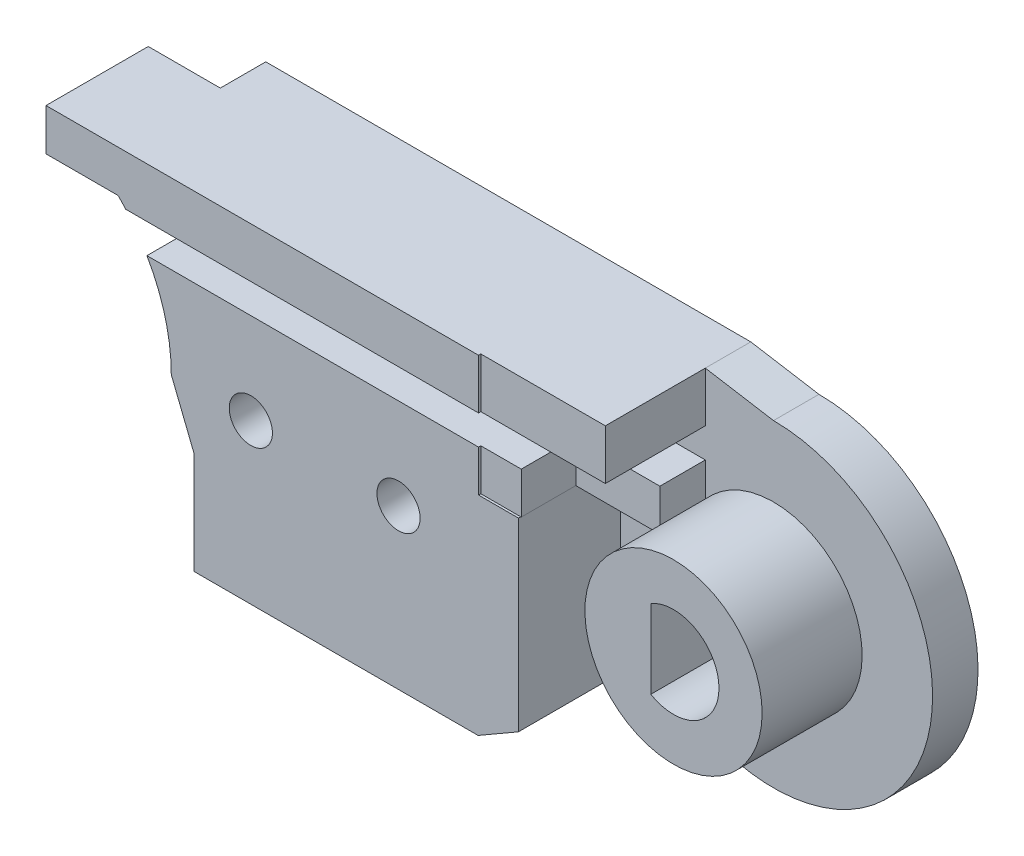
ISO-10303-21;
HEADER;
FILE_DESCRIPTION(('STEP AP214'),'2;1');
FILE_NAME('part.step','',(''),(''),'','','');
FILE_SCHEMA(('AUTOMOTIVE_DESIGN { 1 0 10303 214 1 1 1 1 }'));
ENDSEC;
DATA;
#1=APPLICATION_CONTEXT('core data for automotive mechanical design processes');
#2=APPLICATION_PROTOCOL_DEFINITION('international standard','automotive_design',2000,#1);
#3=PRODUCT_CONTEXT('',#1,'mechanical');
#4=PRODUCT('Part','Part','',(#3));
#5=PRODUCT_RELATED_PRODUCT_CATEGORY('part','',(#4));
#6=PRODUCT_DEFINITION_FORMATION('','',#4);
#7=PRODUCT_DEFINITION_CONTEXT('part definition',#1,'design');
#8=PRODUCT_DEFINITION('design','',#6,#7);
#9=PRODUCT_DEFINITION_SHAPE('','',#8);
#10=(LENGTH_UNIT() NAMED_UNIT(*) SI_UNIT(.MILLI.,.METRE.));
#11=(NAMED_UNIT(*) PLANE_ANGLE_UNIT() SI_UNIT($,.RADIAN.));
#12=(NAMED_UNIT(*) SI_UNIT($,.STERADIAN.) SOLID_ANGLE_UNIT());
#13=UNCERTAINTY_MEASURE_WITH_UNIT(LENGTH_MEASURE(1.E-05),#10,'distance_accuracy_value','');
#14=(GEOMETRIC_REPRESENTATION_CONTEXT(3) GLOBAL_UNCERTAINTY_ASSIGNED_CONTEXT((#13)) GLOBAL_UNIT_ASSIGNED_CONTEXT((#10,
#11,#12)) REPRESENTATION_CONTEXT('',''));
#15=CARTESIAN_POINT('',(0.,0.,0.));
#16=DIRECTION('',(0.,0.,1.));
#17=DIRECTION('',(1.,0.,0.));
#18=AXIS2_PLACEMENT_3D('',#15,#16,#17);
#19=CARTESIAN_POINT('',(0.,0.,6.5));
#20=DIRECTION('',(0.,0.,1.));
#21=DIRECTION('',(1.,0.,0.));
#22=AXIS2_PLACEMENT_3D('',#19,#20,#21);
#23=PLANE('',#22);
#24=DIRECTION('',(0.,-1.,0.));
#25=VECTOR('',#24,1.);
#26=CARTESIAN_POINT('',(21.5203540034992,0.,6.5));
#27=LINE('',#26,#25);
#28=CARTESIAN_POINT('',(21.5203540034992,7.5,6.5));
#29=VERTEX_POINT('',#28);
#30=CARTESIAN_POINT('',(21.5203540034992,5.3,6.5));
#31=VERTEX_POINT('',#30);
#32=EDGE_CURVE('E330',#29,#31,#27,.T.);
#33=ORIENTED_EDGE('',*,*,#32,.F.);
#34=DIRECTION('',(-1.,0.,0.));
#35=VECTOR('',#34,1.);
#36=CARTESIAN_POINT('',(21.5,7.5,6.5));
#37=LINE('',#36,#35);
#38=CARTESIAN_POINT('',(2.48679014755027,7.5,6.5));
#39=VERTEX_POINT('',#38);
#40=EDGE_CURVE('E390',#29,#39,#37,.T.);
#41=ORIENTED_EDGE('',*,*,#40,.T.);
#42=DIRECTION('',(0.,-1.,0.));
#43=VECTOR('',#42,1.);
#44=CARTESIAN_POINT('',(2.48679014755027,7.5,6.5));
#45=LINE('',#44,#43);
#46=CARTESIAN_POINT('',(2.48679014755027,5.65685424949238,6.5));
#47=VERTEX_POINT('',#46);
#48=EDGE_CURVE('E393',#39,#47,#45,.T.);
#49=ORIENTED_EDGE('',*,*,#48,.T.);
#50=DIRECTION('',(1.,0.,0.));
#51=VECTOR('',#50,1.);
#52=CARTESIAN_POINT('',(5.65685424949238,5.65685424949238,6.5));
#53=LINE('',#52,#51);
#54=CARTESIAN_POINT('',(5.65685424949238,5.65685424949238,6.5));
#55=VERTEX_POINT('',#54);
#56=EDGE_CURVE('E396',#47,#55,#53,.T.);
#57=ORIENTED_EDGE('',*,*,#56,.T.);
#58=CARTESIAN_POINT('',(0.,0.,6.5));
#59=DIRECTION('',(0.,0.,-1.));
#60=DIRECTION('',(1.,0.,0.));
#61=AXIS2_PLACEMENT_3D('',#58,#59,#60);
#62=CIRCLE('',#61,8.);
#63=CARTESIAN_POINT('',(5.99249530663145,5.3,6.5));
#64=VERTEX_POINT('',#63);
#65=EDGE_CURVE('E366',#55,#64,#62,.T.);
#66=ORIENTED_EDGE('',*,*,#65,.T.);
#67=DIRECTION('',(-1.,0.,0.));
#68=VECTOR('',#67,1.);
#69=CARTESIAN_POINT('',(18.0980804477077,5.3,6.5));
#70=LINE('',#69,#68);
#71=EDGE_CURVE('E337',#31,#64,#70,.T.);
#72=ORIENTED_EDGE('',*,*,#71,.F.);
#73=EDGE_LOOP('',(#33,#41,#49,#57,#66,#72));
#74=FACE_BOUND('',#73,.T.);
#75=ADVANCED_FACE('F42',(#74),#23,.T.);
#76=CARTESIAN_POINT('',(30.,0.,6.4));
#77=DIRECTION('',(0.,0.,1.));
#78=DIRECTION('',(1.,0.,0.));
#79=AXIS2_PLACEMENT_3D('',#76,#77,#78);
#80=PLANE('',#79);
#81=CARTESIAN_POINT('',(30.,0.,6.4));
#82=DIRECTION('',(0.,0.,1.));
#83=DIRECTION('',(1.,0.,0.));
#84=AXIS2_PLACEMENT_3D('',#81,#82,#83);
#85=CIRCLE('',#84,1.99999999999999);
#86=CARTESIAN_POINT('',(29.,-1.73205080756886,6.4));
#87=VERTEX_POINT('',#86);
#88=CARTESIAN_POINT('',(29.,1.73205080756886,6.4));
#89=VERTEX_POINT('',#88);
#90=EDGE_CURVE('E65',#87,#89,#85,.T.);
#91=ORIENTED_EDGE('',*,*,#90,.F.);
#92=DIRECTION('',(0.,-1.,0.));
#93=VECTOR('',#92,1.);
#94=CARTESIAN_POINT('',(29.,1.73205080756886,6.4));
#95=LINE('',#94,#93);
#96=EDGE_CURVE('E247',#89,#87,#95,.T.);
#97=ORIENTED_EDGE('',*,*,#96,.F.);
#98=EDGE_LOOP('',(#91,#97));
#99=FACE_BOUND('',#98,.T.);
#100=CARTESIAN_POINT('',(30.,0.,6.4));
#101=DIRECTION('',(0.,0.,1.));
#102=DIRECTION('',(1.,0.,0.));
#103=AXIS2_PLACEMENT_3D('',#100,#101,#102);
#104=CIRCLE('',#103,3.89999999999999);
#105=CARTESIAN_POINT('',(33.9,0.,6.4));
#106=VERTEX_POINT('',#105);
#107=EDGE_CURVE('E260',#106,#106,#104,.T.);
#108=ORIENTED_EDGE('',*,*,#107,.T.);
#109=EDGE_LOOP('',(#108));
#110=FACE_BOUND('',#109,.T.);
#111=ADVANCED_FACE('F698',(#99,#110),#80,.T.);
#112=CARTESIAN_POINT('',(30.,0.,0.));
#113=DIRECTION('',(0.,0.,1.));
#114=DIRECTION('',(1.,0.,0.));
#115=AXIS2_PLACEMENT_3D('',#112,#113,#114);
#116=CYLINDRICAL_SURFACE('',#115,1.99999999999999);
#117=ORIENTED_EDGE('',*,*,#90,.T.);
#118=DIRECTION('',(0.,0.,1.));
#119=VECTOR('',#118,1.);
#120=CARTESIAN_POINT('',(29.,1.73205080756886,0.));
#121=LINE('',#120,#119);
#122=CARTESIAN_POINT('',(29.,1.73205080756886,0.));
#123=VERTEX_POINT('',#122);
#124=EDGE_CURVE('E229',#123,#89,#121,.T.);
#125=ORIENTED_EDGE('',*,*,#124,.F.);
#126=CARTESIAN_POINT('',(30.,0.,0.));
#127=DIRECTION('',(0.,0.,1.));
#128=DIRECTION('',(1.,0.,0.));
#129=AXIS2_PLACEMENT_3D('',#126,#127,#128);
#130=CIRCLE('',#129,1.99999999999999);
#131=CARTESIAN_POINT('',(29.,-1.73205080756886,0.));
#132=VERTEX_POINT('',#131);
#133=EDGE_CURVE('E60',#132,#123,#130,.T.);
#134=ORIENTED_EDGE('',*,*,#133,.F.);
#135=DIRECTION('',(0.,0.,1.));
#136=VECTOR('',#135,1.);
#137=CARTESIAN_POINT('',(29.,-1.73205080756886,0.));
#138=LINE('',#137,#136);
#139=EDGE_CURVE('E236',#132,#87,#138,.T.);
#140=ORIENTED_EDGE('',*,*,#139,.T.);
#141=EDGE_LOOP('',(#117,#125,#134,#140));
#142=FACE_BOUND('',#141,.T.);
#143=ADVANCED_FACE('F231',(#142),#116,.F.);
#144=CARTESIAN_POINT('',(29.,1.73205080756886,0.));
#145=DIRECTION('',(-1.,0.,0.));
#146=DIRECTION('',(0.,0.,1.));
#147=AXIS2_PLACEMENT_3D('',#144,#145,#146);
#148=PLANE('',#147);
#149=ORIENTED_EDGE('',*,*,#96,.T.);
#150=ORIENTED_EDGE('',*,*,#139,.F.);
#151=DIRECTION('',(0.,-1.,0.));
#152=VECTOR('',#151,1.);
#153=CARTESIAN_POINT('',(29.,1.73205080756886,0.));
#154=LINE('',#153,#152);
#155=EDGE_CURVE('E237',#123,#132,#154,.T.);
#156=ORIENTED_EDGE('',*,*,#155,.F.);
#157=ORIENTED_EDGE('',*,*,#124,.T.);
#158=EDGE_LOOP('',(#149,#150,#156,#157));
#159=FACE_BOUND('',#158,.T.);
#160=ADVANCED_FACE('F240',(#159),#148,.F.);
#161=CARTESIAN_POINT('',(18.,0.,4.5));
#162=DIRECTION('',(0.,0.,-1.));
#163=DIRECTION('',(-1.,0.,0.));
#164=AXIS2_PLACEMENT_3D('',#161,#162,#163);
#165=CYLINDRICAL_SURFACE('',#164,2.);
#166=CARTESIAN_POINT('',(18.,0.,4.5));
#167=DIRECTION('',(0.,0.,-1.));
#168=DIRECTION('',(-1.,0.,0.));
#169=AXIS2_PLACEMENT_3D('',#166,#167,#168);
#170=CIRCLE('',#169,2.);
#171=CARTESIAN_POINT('',(16.,0.,4.5));
#172=VERTEX_POINT('',#171);
#173=EDGE_CURVE('E545',#172,#172,#170,.T.);
#174=ORIENTED_EDGE('',*,*,#173,.F.);
#175=EDGE_LOOP('',(#174));
#176=FACE_BOUND('',#175,.T.);
#177=CARTESIAN_POINT('',(18.,0.,0.));
#178=DIRECTION('',(0.,0.,-1.));
#179=DIRECTION('',(-1.,0.,0.));
#180=AXIS2_PLACEMENT_3D('',#177,#178,#179);
#181=CIRCLE('',#180,2.);
#182=CARTESIAN_POINT('',(16.,0.,0.));
#183=VERTEX_POINT('',#182);
#184=EDGE_CURVE('E551',#183,#183,#181,.T.);
#185=ORIENTED_EDGE('',*,*,#184,.T.);
#186=EDGE_LOOP('',(#185));
#187=FACE_BOUND('',#186,.T.);
#188=ADVANCED_FACE('F900',(#176,#187),#165,.F.);
#189=CARTESIAN_POINT('',(11.5,0.,4.5));
#190=DIRECTION('',(0.,0.,-1.));
#191=DIRECTION('',(-1.,0.,0.));
#192=AXIS2_PLACEMENT_3D('',#189,#190,#191);
#193=CYLINDRICAL_SURFACE('',#192,2.);
#194=CARTESIAN_POINT('',(11.5,0.,4.5));
#195=DIRECTION('',(0.,0.,-1.));
#196=DIRECTION('',(-1.,0.,0.));
#197=AXIS2_PLACEMENT_3D('',#194,#195,#196);
#198=CIRCLE('',#197,2.);
#199=CARTESIAN_POINT('',(9.5,0.,4.5));
#200=VERTEX_POINT('',#199);
#201=EDGE_CURVE('E531',#200,#200,#198,.T.);
#202=ORIENTED_EDGE('',*,*,#201,.F.);
#203=EDGE_LOOP('',(#202));
#204=FACE_BOUND('',#203,.T.);
#205=CARTESIAN_POINT('',(11.5,0.,0.));
#206=DIRECTION('',(0.,0.,-1.));
#207=DIRECTION('',(-1.,0.,0.));
#208=AXIS2_PLACEMENT_3D('',#205,#206,#207);
#209=CIRCLE('',#208,2.);
#210=CARTESIAN_POINT('',(9.5,0.,0.));
#211=VERTEX_POINT('',#210);
#212=EDGE_CURVE('E539',#211,#211,#209,.T.);
#213=ORIENTED_EDGE('',*,*,#212,.T.);
#214=EDGE_LOOP('',(#213));
#215=FACE_BOUND('',#214,.T.);
#216=ADVANCED_FACE('F712',(#204,#215),#193,.F.);
#217=CARTESIAN_POINT('',(30.,0.,6.4));
#218=DIRECTION('',(0.,0.,-1.));
#219=DIRECTION('',(-1.,0.,0.));
#220=AXIS2_PLACEMENT_3D('',#217,#218,#219);
#221=CYLINDRICAL_SURFACE('',#220,3.89999999999999);
#222=ORIENTED_EDGE('',*,*,#107,.F.);
#223=EDGE_LOOP('',(#222));
#224=FACE_BOUND('',#223,.T.);
#225=CARTESIAN_POINT('',(30.,0.,2.));
#226=DIRECTION('',(0.,0.,1.));
#227=DIRECTION('',(1.,0.,0.));
#228=AXIS2_PLACEMENT_3D('',#225,#226,#227);
#229=CIRCLE('',#228,3.89999999999999);
#230=CARTESIAN_POINT('',(26.7608042864271,2.1720062451962,2.));
#231=VERTEX_POINT('',#230);
#232=CARTESIAN_POINT('',(27.,2.49198715887543,2.));
#233=VERTEX_POINT('',#232);
#234=EDGE_CURVE('E258',#231,#233,#229,.T.);
#235=ORIENTED_EDGE('',*,*,#234,.T.);
#236=DIRECTION('',(0.,0.,-1.));
#237=VECTOR('',#236,1.);
#238=CARTESIAN_POINT('',(27.,2.49198715887543,6.4));
#239=LINE('',#238,#237);
#240=CARTESIAN_POINT('',(27.,2.49198715887543,4.));
#241=VERTEX_POINT('',#240);
#242=EDGE_CURVE('E271',#233,#241,#239,.F.);
#243=ORIENTED_EDGE('',*,*,#242,.T.);
#244=CARTESIAN_POINT('',(30.,0.,4.));
#245=DIRECTION('',(0.,0.,-1.));
#246=DIRECTION('',(-1.,0.,0.));
#247=AXIS2_PLACEMENT_3D('',#244,#245,#246);
#248=CIRCLE('',#247,3.89999999999999);
#249=CARTESIAN_POINT('',(26.7608042864271,2.1720062451962,4.));
#250=VERTEX_POINT('',#249);
#251=EDGE_CURVE('E12',#241,#250,#248,.F.);
#252=ORIENTED_EDGE('',*,*,#251,.T.);
#253=DIRECTION('',(0.,0.,-1.));
#254=VECTOR('',#253,1.);
#255=CARTESIAN_POINT('',(26.7608042864271,2.1720062451962,6.4));
#256=LINE('',#255,#254);
#257=EDGE_CURVE('E264',#250,#231,#256,.T.);
#258=ORIENTED_EDGE('',*,*,#257,.T.);
#259=EDGE_LOOP('',(#235,#243,#252,#258));
#260=FACE_BOUND('',#259,.T.);
#261=ADVANCED_FACE('F645',(#224,#260),#221,.T.);
#262=CARTESIAN_POINT('',(30.,0.,2.));
#263=DIRECTION('',(0.,0.,-1.));
#264=DIRECTION('',(-1.,0.,0.));
#265=AXIS2_PLACEMENT_3D('',#262,#263,#264);
#266=CYLINDRICAL_SURFACE('',#265,7.);
#267=CARTESIAN_POINT('',(30.,0.,0.));
#268=DIRECTION('',(0.,0.,1.));
#269=DIRECTION('',(1.,0.,0.));
#270=AXIS2_PLACEMENT_3D('',#267,#268,#269);
#271=CIRCLE('',#270,7.);
#272=CARTESIAN_POINT('',(25.0502525316942,-4.94974746830584,0.));
#273=VERTEX_POINT('',#272);
#274=CARTESIAN_POINT('',(30.,7.00000000000001,0.));
#275=VERTEX_POINT('',#274);
#276=EDGE_CURVE('E449',#273,#275,#271,.T.);
#277=ORIENTED_EDGE('',*,*,#276,.T.);
#278=DIRECTION('',(0.,0.,-1.));
#279=VECTOR('',#278,1.);
#280=CARTESIAN_POINT('',(30.,7.00000000000001,2.));
#281=LINE('',#280,#279);
#282=CARTESIAN_POINT('',(30.,7.00000000000001,2.));
#283=VERTEX_POINT('',#282);
#284=EDGE_CURVE('E498',#283,#275,#281,.T.);
#285=ORIENTED_EDGE('',*,*,#284,.F.);
#286=CARTESIAN_POINT('',(30.,0.,2.));
#287=DIRECTION('',(0.,0.,1.));
#288=DIRECTION('',(1.,0.,0.));
#289=AXIS2_PLACEMENT_3D('',#286,#287,#288);
#290=CIRCLE('',#289,7.);
#291=CARTESIAN_POINT('',(25.0502525316942,-4.94974746830584,2.));
#292=VERTEX_POINT('',#291);
#293=EDGE_CURVE('E457',#292,#283,#290,.T.);
#294=ORIENTED_EDGE('',*,*,#293,.F.);
#295=DIRECTION('',(0.,0.,-1.));
#296=VECTOR('',#295,1.);
#297=CARTESIAN_POINT('',(25.0502525316942,-4.94974746830584,2.));
#298=LINE('',#297,#296);
#299=EDGE_CURVE('E494',#292,#273,#298,.T.);
#300=ORIENTED_EDGE('',*,*,#299,.T.);
#301=EDGE_LOOP('',(#277,#285,#294,#300));
#302=FACE_BOUND('',#301,.T.);
#303=ADVANCED_FACE('F652',(#302),#266,.T.);
#304=CARTESIAN_POINT('',(5.65685424949238,5.65685424949238,2.));
#305=DIRECTION('',(-1.,0.,0.));
#306=DIRECTION('',(0.,0.,1.));
#307=AXIS2_PLACEMENT_3D('',#304,#305,#306);
#308=PLANE('',#307);
#309=DIRECTION('',(0.,1.,0.));
#310=VECTOR('',#309,1.);
#311=CARTESIAN_POINT('',(5.65685424949238,5.65685424949238,0.));
#312=LINE('',#311,#310);
#313=CARTESIAN_POINT('',(5.65685424949238,5.65685424949238,0.));
#314=VERTEX_POINT('',#313);
#315=CARTESIAN_POINT('',(5.65685424949238,7.5,0.));
#316=VERTEX_POINT('',#315);
#317=EDGE_CURVE('E480',#314,#316,#312,.T.);
#318=ORIENTED_EDGE('',*,*,#317,.F.);
#319=DIRECTION('',(0.,0.,-1.));
#320=VECTOR('',#319,1.);
#321=CARTESIAN_POINT('',(5.65685424949238,5.65685424949238,2.));
#322=LINE('',#321,#320);
#323=CARTESIAN_POINT('',(5.65685424949238,5.65685424949238,2.));
#324=VERTEX_POINT('',#323);
#325=EDGE_CURVE('E508',#324,#314,#322,.T.);
#326=ORIENTED_EDGE('',*,*,#325,.F.);
#327=DIRECTION('',(0.,1.,0.));
#328=VECTOR('',#327,1.);
#329=CARTESIAN_POINT('',(5.65685424949238,5.65685424949238,2.));
#330=LINE('',#329,#328);
#331=CARTESIAN_POINT('',(5.65685424949238,7.5,2.));
#332=VERTEX_POINT('',#331);
#333=EDGE_CURVE('E448',#324,#332,#330,.T.);
#334=ORIENTED_EDGE('',*,*,#333,.T.);
#335=DIRECTION('',(0.,0.,-1.));
#336=VECTOR('',#335,1.);
#337=CARTESIAN_POINT('',(5.65685424949238,7.5,2.));
#338=LINE('',#337,#336);
#339=EDGE_CURVE('E505',#332,#316,#338,.T.);
#340=ORIENTED_EDGE('',*,*,#339,.T.);
#341=EDGE_LOOP('',(#318,#326,#334,#340));
#342=FACE_BOUND('',#341,.T.);
#343=ADVANCED_FACE('F683',(#342),#308,.T.);
#344=CARTESIAN_POINT('',(30.,7.00000000000001,2.));
#345=DIRECTION('',(-0.164398987305353,-0.986393923832144,0.));
#346=DIRECTION('',(0.986393923832144,-0.164398987305353,0.));
#347=AXIS2_PLACEMENT_3D('',#344,#345,#346);
#348=PLANE('',#347);
#349=DIRECTION('',(-0.986393923832145,0.164398987305353,0.));
#350=VECTOR('',#349,1.);
#351=CARTESIAN_POINT('',(30.,7.00000000000001,0.));
#352=LINE('',#351,#350);
#353=CARTESIAN_POINT('',(27.,7.5,0.));
#354=VERTEX_POINT('',#353);
#355=EDGE_CURVE('E488',#275,#354,#352,.T.);
#356=ORIENTED_EDGE('',*,*,#355,.T.);
#357=DIRECTION('',(0.,0.,-1.));
#358=VECTOR('',#357,1.);
#359=CARTESIAN_POINT('',(27.,7.5,2.));
#360=LINE('',#359,#358);
#361=CARTESIAN_POINT('',(27.,7.5,2.));
#362=VERTEX_POINT('',#361);
#363=EDGE_CURVE('E502',#362,#354,#360,.T.);
#364=ORIENTED_EDGE('',*,*,#363,.F.);
#365=DIRECTION('',(-0.986393923832145,0.164398987305353,0.));
#366=VECTOR('',#365,1.);
#367=CARTESIAN_POINT('',(30.,7.00000000000001,2.));
#368=LINE('',#367,#366);
#369=EDGE_CURVE('E453',#283,#362,#368,.T.);
#370=ORIENTED_EDGE('',*,*,#369,.F.);
#371=ORIENTED_EDGE('',*,*,#284,.T.);
#372=EDGE_LOOP('',(#356,#364,#370,#371));
#373=FACE_BOUND('',#372,.T.);
#374=ADVANCED_FACE('F656',(#373),#348,.F.);
#375=CARTESIAN_POINT('',(8.,0.,2.));
#376=DIRECTION('',(0.928476690885259,0.371390676354104,0.));
#377=DIRECTION('',(-0.371390676354104,0.928476690885259,0.));
#378=AXIS2_PLACEMENT_3D('',#375,#376,#377);
#379=PLANE('',#378);
#380=DIRECTION('',(0.371390676354104,-0.928476690885259,0.));
#381=VECTOR('',#380,1.);
#382=CARTESIAN_POINT('',(8.,0.,0.));
#383=LINE('',#382,#381);
#384=CARTESIAN_POINT('',(8.,0.,0.));
#385=VERTEX_POINT('',#384);
#386=CARTESIAN_POINT('',(9.,-2.5,0.));
#387=VERTEX_POINT('',#386);
#388=EDGE_CURVE('E472',#385,#387,#383,.T.);
#389=ORIENTED_EDGE('',*,*,#388,.T.);
#390=DIRECTION('',(0.,0.,-1.));
#391=VECTOR('',#390,1.);
#392=CARTESIAN_POINT('',(9.,-2.5,2.));
#393=LINE('',#392,#391);
#394=CARTESIAN_POINT('',(9.,-2.5,6.5));
#395=VERTEX_POINT('',#394);
#396=EDGE_CURVE('E514',#395,#387,#393,.T.);
#397=ORIENTED_EDGE('',*,*,#396,.F.);
#398=DIRECTION('',(0.371390676354105,-0.928476690885259,0.));
#399=VECTOR('',#398,1.);
#400=CARTESIAN_POINT('',(8.,0.,6.5));
#401=LINE('',#400,#399);
#402=CARTESIAN_POINT('',(8.,0.,6.5));
#403=VERTEX_POINT('',#402);
#404=EDGE_CURVE('E370',#403,#395,#401,.T.);
#405=ORIENTED_EDGE('',*,*,#404,.F.);
#406=DIRECTION('',(0.,0.,-1.));
#407=VECTOR('',#406,1.);
#408=CARTESIAN_POINT('',(8.,0.,2.));
#409=LINE('',#408,#407);
#410=EDGE_CURVE('E511',#403,#385,#409,.T.);
#411=ORIENTED_EDGE('',*,*,#410,.T.);
#412=EDGE_LOOP('',(#389,#397,#405,#411));
#413=FACE_BOUND('',#412,.T.);
#414=ADVANCED_FACE('F600',(#413),#379,.F.);
#415=CARTESIAN_POINT('',(9.,-6.99999999999999,2.));
#416=DIRECTION('',(-1.,0.,0.));
#417=DIRECTION('',(0.,0.,1.));
#418=AXIS2_PLACEMENT_3D('',#415,#416,#417);
#419=PLANE('',#418);
#420=DIRECTION('',(0.,1.,0.));
#421=VECTOR('',#420,1.);
#422=CARTESIAN_POINT('',(9.,-6.99999999999999,0.));
#423=LINE('',#422,#421);
#424=CARTESIAN_POINT('',(9.,-6.99999999999999,0.));
#425=VERTEX_POINT('',#424);
#426=EDGE_CURVE('E468',#425,#387,#423,.T.);
#427=ORIENTED_EDGE('',*,*,#426,.F.);
#428=DIRECTION('',(0.,0.,-1.));
#429=VECTOR('',#428,1.);
#430=CARTESIAN_POINT('',(9.,-6.99999999999999,2.));
#431=LINE('',#430,#429);
#432=CARTESIAN_POINT('',(9.,-6.99999999999999,6.5));
#433=VERTEX_POINT('',#432);
#434=EDGE_CURVE('E517',#433,#425,#431,.T.);
#435=ORIENTED_EDGE('',*,*,#434,.F.);
#436=DIRECTION('',(0.,-1.,0.));
#437=VECTOR('',#436,1.);
#438=CARTESIAN_POINT('',(9.,-2.5,6.5));
#439=LINE('',#438,#437);
#440=EDGE_CURVE('E375',#395,#433,#439,.T.);
#441=ORIENTED_EDGE('',*,*,#440,.F.);
#442=ORIENTED_EDGE('',*,*,#396,.T.);
#443=EDGE_LOOP('',(#427,#435,#441,#442));
#444=FACE_BOUND('',#443,.T.);
#445=ADVANCED_FACE('F603',(#444),#419,.T.);
#446=CARTESIAN_POINT('',(25.0502525316942,-4.94974746830585,2.));
#447=DIRECTION('',(0.500093895229062,-0.865971186561437,0.));
#448=DIRECTION('',(0.865971186561437,0.500093895229062,0.));
#449=AXIS2_PLACEMENT_3D('',#446,#447,#448);
#450=PLANE('',#449);
#451=DIRECTION('',(-0.865971186561437,-0.500093895229062,0.));
#452=VECTOR('',#451,1.);
#453=CARTESIAN_POINT('',(25.0502525316942,-4.94974746830585,0.));
#454=LINE('',#453,#452);
#455=CARTESIAN_POINT('',(21.5,-6.99999999999999,0.));
#456=VERTEX_POINT('',#455);
#457=EDGE_CURVE('E443',#273,#456,#454,.T.);
#458=ORIENTED_EDGE('',*,*,#457,.F.);
#459=ORIENTED_EDGE('',*,*,#299,.F.);
#460=DIRECTION('',(-0.865971186561437,-0.500093895229062,0.));
#461=VECTOR('',#460,1.);
#462=CARTESIAN_POINT('',(25.0502525316942,-4.94974746830585,2.));
#463=LINE('',#462,#461);
#464=CARTESIAN_POINT('',(23.2751262658471,-5.97487373415292,2.));
#465=VERTEX_POINT('',#464);
#466=EDGE_CURVE('E444',#292,#465,#463,.T.);
#467=ORIENTED_EDGE('',*,*,#466,.T.);
#468=DIRECTION('',(0.,0.,-1.));
#469=VECTOR('',#468,1.);
#470=CARTESIAN_POINT('',(23.2751262658471,-5.97487373415292,6.5));
#471=LINE('',#470,#469);
#472=CARTESIAN_POINT('',(23.2751262658471,-5.97487373415292,6.5));
#473=VERTEX_POINT('',#472);
#474=EDGE_CURVE('E439',#473,#465,#471,.T.);
#475=ORIENTED_EDGE('',*,*,#474,.F.);
#476=DIRECTION('',(0.865971186561437,0.500093895229063,0.));
#477=VECTOR('',#476,1.);
#478=CARTESIAN_POINT('',(21.5,-6.99999999999999,6.5));
#479=LINE('',#478,#477);
#480=CARTESIAN_POINT('',(21.5,-6.99999999999999,6.5));
#481=VERTEX_POINT('',#480);
#482=EDGE_CURVE('E383',#481,#473,#479,.T.);
#483=ORIENTED_EDGE('',*,*,#482,.F.);
#484=DIRECTION('',(0.,0.,-1.));
#485=VECTOR('',#484,1.);
#486=CARTESIAN_POINT('',(21.5,-6.99999999999999,2.));
#487=LINE('',#486,#485);
#488=EDGE_CURVE('E460',#481,#456,#487,.T.);
#489=ORIENTED_EDGE('',*,*,#488,.T.);
#490=EDGE_LOOP('',(#458,#459,#467,#475,#483,#489));
#491=FACE_BOUND('',#490,.T.);
#492=ADVANCED_FACE('F44',(#491),#450,.T.);
#493=CARTESIAN_POINT('',(27.,2.1720062451962,6.5));
#494=DIRECTION('',(0.,1.,0.));
#495=DIRECTION('',(0.,0.,1.));
#496=AXIS2_PLACEMENT_3D('',#493,#494,#495);
#497=PLANE('',#496);
#498=ORIENTED_EDGE('',*,*,#257,.F.);
#499=DIRECTION('',(1.,0.,0.));
#500=VECTOR('',#499,1.);
#501=CARTESIAN_POINT('',(27.,2.1720062451962,4.));
#502=LINE('',#501,#500);
#503=CARTESIAN_POINT('',(23.3,2.1720062451962,4.));
#504=VERTEX_POINT('',#503);
#505=EDGE_CURVE('E276',#504,#250,#502,.T.);
#506=ORIENTED_EDGE('',*,*,#505,.F.);
#507=DIRECTION('',(0.,0.,1.));
#508=VECTOR('',#507,1.);
#509=CARTESIAN_POINT('',(23.3,2.1720062451962,4.));
#510=LINE('',#509,#508);
#511=CARTESIAN_POINT('',(23.3,2.1720062451962,6.4));
#512=VERTEX_POINT('',#511);
#513=EDGE_CURVE('E292',#504,#512,#510,.T.);
#514=ORIENTED_EDGE('',*,*,#513,.T.);
#515=DIRECTION('',(1.,0.,0.));
#516=VECTOR('',#515,1.);
#517=CARTESIAN_POINT('',(27.,2.1720062451962,6.4));
#518=LINE('',#517,#516);
#519=CARTESIAN_POINT('',(23.2751262658471,2.1720062451962,6.4));
#520=VERTEX_POINT('',#519);
#521=EDGE_CURVE('E296',#520,#512,#518,.T.);
#522=ORIENTED_EDGE('',*,*,#521,.F.);
#523=DIRECTION('',(0.,0.,-1.));
#524=VECTOR('',#523,1.);
#525=CARTESIAN_POINT('',(23.2751262658471,2.1720062451962,6.5));
#526=LINE('',#525,#524);
#527=CARTESIAN_POINT('',(23.2751262658471,2.1720062451962,2.));
#528=VERTEX_POINT('',#527);
#529=EDGE_CURVE('E435',#520,#528,#526,.T.);
#530=ORIENTED_EDGE('',*,*,#529,.T.);
#531=DIRECTION('',(1.,0.,0.));
#532=VECTOR('',#531,1.);
#533=CARTESIAN_POINT('',(27.,2.1720062451962,2.));
#534=LINE('',#533,#532);
#535=EDGE_CURVE('E403',#528,#231,#534,.T.);
#536=ORIENTED_EDGE('',*,*,#535,.T.);
#537=EDGE_LOOP('',(#498,#506,#514,#522,#530,#536));
#538=FACE_BOUND('',#537,.T.);
#539=ADVANCED_FACE('F629',(#538),#497,.F.);
#540=CARTESIAN_POINT('',(2.48679014755027,7.5,6.5));
#541=DIRECTION('',(1.,0.,0.));
#542=DIRECTION('',(0.,0.,-1.));
#543=AXIS2_PLACEMENT_3D('',#540,#541,#542);
#544=PLANE('',#543);
#545=DIRECTION('',(0.,-1.,0.));
#546=VECTOR('',#545,1.);
#547=CARTESIAN_POINT('',(2.48679014755027,7.5,2.));
#548=LINE('',#547,#546);
#549=CARTESIAN_POINT('',(2.48679014755027,7.5,2.));
#550=VERTEX_POINT('',#549);
#551=CARTESIAN_POINT('',(2.48679014755027,5.65685424949238,2.));
#552=VERTEX_POINT('',#551);
#553=EDGE_CURVE('E414',#550,#552,#548,.T.);
#554=ORIENTED_EDGE('',*,*,#553,.T.);
#555=DIRECTION('',(0.,0.,-1.));
#556=VECTOR('',#555,1.);
#557=CARTESIAN_POINT('',(2.48679014755027,5.65685424949238,6.5));
#558=LINE('',#557,#556);
#559=EDGE_CURVE('E424',#47,#552,#558,.T.);
#560=ORIENTED_EDGE('',*,*,#559,.F.);
#561=ORIENTED_EDGE('',*,*,#48,.F.);
#562=DIRECTION('',(0.,0.,-1.));
#563=VECTOR('',#562,1.);
#564=CARTESIAN_POINT('',(2.48679014755027,7.5,6.5));
#565=LINE('',#564,#563);
#566=EDGE_CURVE('E428',#39,#550,#565,.T.);
#567=ORIENTED_EDGE('',*,*,#566,.T.);
#568=EDGE_LOOP('',(#554,#560,#561,#567));
#569=FACE_BOUND('',#568,.T.);
#570=ADVANCED_FACE('F734',(#569),#544,.F.);
#571=CARTESIAN_POINT('',(27.,7.5,6.5));
#572=DIRECTION('',(-1.,0.,0.));
#573=DIRECTION('',(0.,0.,1.));
#574=AXIS2_PLACEMENT_3D('',#571,#572,#573);
#575=PLANE('',#574);
#576=DIRECTION('',(0.,0.,-1.));
#577=VECTOR('',#576,1.);
#578=CARTESIAN_POINT('',(27.,7.5,6.5));
#579=LINE('',#578,#577);
#580=CARTESIAN_POINT('',(27.,7.5,6.4));
#581=VERTEX_POINT('',#580);
#582=EDGE_CURVE('E432',#581,#362,#579,.T.);
#583=ORIENTED_EDGE('',*,*,#582,.F.);
#584=DIRECTION('',(0.,1.,0.));
#585=VECTOR('',#584,1.);
#586=CARTESIAN_POINT('',(27.,2.1720062451962,6.4));
#587=LINE('',#586,#585);
#588=CARTESIAN_POINT('',(27.,5.3,6.4));
#589=VERTEX_POINT('',#588);
#590=EDGE_CURVE('E303',#589,#581,#587,.T.);
#591=ORIENTED_EDGE('',*,*,#590,.F.);
#592=DIRECTION('',(0.,0.,-1.));
#593=VECTOR('',#592,1.);
#594=CARTESIAN_POINT('',(27.,5.3,6.5));
#595=LINE('',#594,#593);
#596=CARTESIAN_POINT('',(27.,5.3,2.));
#597=VERTEX_POINT('',#596);
#598=EDGE_CURVE('E340',#589,#597,#595,.T.);
#599=ORIENTED_EDGE('',*,*,#598,.T.);
#600=DIRECTION('',(0.,1.,0.));
#601=VECTOR('',#600,1.);
#602=CARTESIAN_POINT('',(27.,7.5,2.));
#603=LINE('',#602,#601);
#604=EDGE_CURVE('E407',#597,#362,#603,.T.);
#605=ORIENTED_EDGE('',*,*,#604,.T.);
#606=EDGE_LOOP('',(#583,#591,#599,#605));
#607=FACE_BOUND('',#606,.T.);
#608=ADVANCED_FACE('F665',(#607),#575,.F.);
#609=CARTESIAN_POINT('',(0.,0.,2.));
#610=DIRECTION('',(0.,0.,-1.));
#611=DIRECTION('',(-1.,0.,0.));
#612=AXIS2_PLACEMENT_3D('',#609,#610,#611);
#613=CYLINDRICAL_SURFACE('',#612,8.);
#614=CARTESIAN_POINT('',(0.,0.,2.));
#615=DIRECTION('',(0.,0.,-1.));
#616=DIRECTION('',(-1.,0.,0.));
#617=AXIS2_PLACEMENT_3D('',#614,#615,#616);
#618=CIRCLE('',#617,8.);
#619=CARTESIAN_POINT('',(5.99249530663146,5.3,2.));
#620=VERTEX_POINT('',#619);
#621=CARTESIAN_POINT('',(6.92820323027551,4.,2.));
#622=VERTEX_POINT('',#621);
#623=EDGE_CURVE('E362',#620,#622,#618,.T.);
#624=ORIENTED_EDGE('',*,*,#623,.F.);
#625=DIRECTION('',(0.,0.,-1.));
#626=VECTOR('',#625,1.);
#627=CARTESIAN_POINT('',(5.99249530663146,5.3,2.));
#628=LINE('',#627,#626);
#629=EDGE_CURVE('E358',#620,#64,#628,.F.);
#630=ORIENTED_EDGE('',*,*,#629,.T.);
#631=ORIENTED_EDGE('',*,*,#65,.F.);
#632=DIRECTION('',(0.,0.,-1.));
#633=VECTOR('',#632,1.);
#634=CARTESIAN_POINT('',(5.65685424949238,5.65685424949238,6.5));
#635=LINE('',#634,#633);
#636=EDGE_CURVE('E399',#55,#324,#635,.T.);
#637=ORIENTED_EDGE('',*,*,#636,.T.);
#638=ORIENTED_EDGE('',*,*,#325,.T.);
#639=CARTESIAN_POINT('',(0.,0.,0.));
#640=DIRECTION('',(0.,0.,1.));
#641=DIRECTION('',(1.,0.,0.));
#642=AXIS2_PLACEMENT_3D('',#639,#640,#641);
#643=CIRCLE('',#642,8.);
#644=EDGE_CURVE('E476',#385,#314,#643,.T.);
#645=ORIENTED_EDGE('',*,*,#644,.F.);
#646=ORIENTED_EDGE('',*,*,#410,.F.);
#647=CARTESIAN_POINT('',(6.92820323027551,4.,6.5));
#648=VERTEX_POINT('',#647);
#649=EDGE_CURVE('E371',#648,#403,#62,.T.);
#650=ORIENTED_EDGE('',*,*,#649,.F.);
#651=DIRECTION('',(0.,0.,-1.));
#652=VECTOR('',#651,1.);
#653=CARTESIAN_POINT('',(6.92820323027551,4.,2.));
#654=LINE('',#653,#652);
#655=EDGE_CURVE('E354',#648,#622,#654,.T.);
#656=ORIENTED_EDGE('',*,*,#655,.T.);
#657=EDGE_LOOP('',(#624,#630,#631,#637,#638,#645,#646,#650,#656));
#658=FACE_BOUND('',#657,.T.);
#659=ADVANCED_FACE('F597',(#658),#613,.F.);
#660=CARTESIAN_POINT('',(0.,0.,2.));
#661=DIRECTION('',(0.,0.,1.));
#662=DIRECTION('',(1.,0.,0.));
#663=AXIS2_PLACEMENT_3D('',#660,#661,#662);
#664=PLANE('',#663);
#665=CARTESIAN_POINT('',(27.,4.,2.));
#666=VERTEX_POINT('',#665);
#667=EDGE_CURVE('E408',#233,#666,#603,.T.);
#668=ORIENTED_EDGE('',*,*,#667,.F.);
#669=ORIENTED_EDGE('',*,*,#234,.F.);
#670=ORIENTED_EDGE('',*,*,#535,.F.);
#671=DIRECTION('',(0.,1.,0.));
#672=VECTOR('',#671,1.);
#673=CARTESIAN_POINT('',(23.2751262658471,-5.97487373415292,2.));
#674=LINE('',#673,#672);
#675=EDGE_CURVE('E365',#465,#528,#674,.T.);
#676=ORIENTED_EDGE('',*,*,#675,.F.);
#677=ORIENTED_EDGE('',*,*,#466,.F.);
#678=ORIENTED_EDGE('',*,*,#293,.T.);
#679=ORIENTED_EDGE('',*,*,#369,.T.);
#680=ORIENTED_EDGE('',*,*,#604,.F.);
#681=DIRECTION('',(-1.,0.,0.));
#682=VECTOR('',#681,1.);
#683=CARTESIAN_POINT('',(18.0980804477077,5.3,2.));
#684=LINE('',#683,#682);
#685=EDGE_CURVE('E336',#597,#620,#684,.T.);
#686=ORIENTED_EDGE('',*,*,#685,.T.);
#687=ORIENTED_EDGE('',*,*,#623,.T.);
#688=DIRECTION('',(1.,0.,0.));
#689=VECTOR('',#688,1.);
#690=CARTESIAN_POINT('',(27.,4.,2.));
#691=LINE('',#690,#689);
#692=EDGE_CURVE('E341',#622,#666,#691,.T.);
#693=ORIENTED_EDGE('',*,*,#692,.T.);
#694=EDGE_LOOP('',(#668,#669,#670,#676,#677,#678,#679,#680,#686,#687,#693));
#695=FACE_BOUND('',#694,.T.);
#696=ADVANCED_FACE('F643',(#695),#664,.T.);
#697=ORIENTED_EDGE('',*,*,#242,.F.);
#698=ORIENTED_EDGE('',*,*,#667,.T.);
#699=DIRECTION('',(0.,0.,-1.));
#700=VECTOR('',#699,1.);
#701=CARTESIAN_POINT('',(27.,4.,6.5));
#702=LINE('',#701,#700);
#703=CARTESIAN_POINT('',(27.,4.,4.));
#704=VERTEX_POINT('',#703);
#705=EDGE_CURVE('E350',#704,#666,#702,.T.);
#706=ORIENTED_EDGE('',*,*,#705,.F.);
#707=DIRECTION('',(0.,1.,0.));
#708=VECTOR('',#707,1.);
#709=CARTESIAN_POINT('',(27.,2.1720062451962,4.));
#710=LINE('',#709,#708);
#711=EDGE_CURVE('E279',#241,#704,#710,.T.);
#712=ORIENTED_EDGE('',*,*,#711,.F.);
#713=EDGE_LOOP('',(#697,#698,#706,#712));
#714=FACE_BOUND('',#713,.T.);
#715=ADVANCED_FACE('F640',(#714),#575,.F.);
#716=CARTESIAN_POINT('',(0.,0.,4.));
#717=DIRECTION('',(0.,0.,-1.));
#718=DIRECTION('',(-1.,0.,0.));
#719=AXIS2_PLACEMENT_3D('',#716,#717,#718);
#720=PLANE('',#719);
#721=ORIENTED_EDGE('',*,*,#251,.F.);
#722=ORIENTED_EDGE('',*,*,#711,.T.);
#723=DIRECTION('',(-1.,0.,0.));
#724=VECTOR('',#723,1.);
#725=CARTESIAN_POINT('',(27.,4.,4.));
#726=LINE('',#725,#724);
#727=CARTESIAN_POINT('',(23.3,4.,4.));
#728=VERTEX_POINT('',#727);
#729=EDGE_CURVE('E282',#704,#728,#726,.T.);
#730=ORIENTED_EDGE('',*,*,#729,.T.);
#731=DIRECTION('',(0.,-1.,0.));
#732=VECTOR('',#731,1.);
#733=CARTESIAN_POINT('',(23.3,2.1720062451962,4.));
#734=LINE('',#733,#732);
#735=EDGE_CURVE('E285',#728,#504,#734,.T.);
#736=ORIENTED_EDGE('',*,*,#735,.T.);
#737=ORIENTED_EDGE('',*,*,#505,.T.);
#738=EDGE_LOOP('',(#721,#722,#730,#736,#737));
#739=FACE_BOUND('',#738,.T.);
#740=ADVANCED_FACE('F635',(#739),#720,.F.);
#741=CARTESIAN_POINT('',(23.3,2.1720062451962,4.));
#742=DIRECTION('',(-1.,0.,0.));
#743=DIRECTION('',(0.,0.,1.));
#744=AXIS2_PLACEMENT_3D('',#741,#742,#743);
#745=PLANE('',#744);
#746=DIRECTION('',(0.,-1.,0.));
#747=VECTOR('',#746,1.);
#748=CARTESIAN_POINT('',(23.3,2.1720062451962,6.4));
#749=LINE('',#748,#747);
#750=CARTESIAN_POINT('',(23.3,4.,6.4));
#751=VERTEX_POINT('',#750);
#752=EDGE_CURVE('E275',#751,#512,#749,.T.);
#753=ORIENTED_EDGE('',*,*,#752,.T.);
#754=ORIENTED_EDGE('',*,*,#513,.F.);
#755=ORIENTED_EDGE('',*,*,#735,.F.);
#756=DIRECTION('',(0.,0.,1.));
#757=VECTOR('',#756,1.);
#758=CARTESIAN_POINT('',(23.3,4.,4.));
#759=LINE('',#758,#757);
#760=EDGE_CURVE('E289',#728,#751,#759,.T.);
#761=ORIENTED_EDGE('',*,*,#760,.T.);
#762=EDGE_LOOP('',(#753,#754,#755,#761));
#763=FACE_BOUND('',#762,.T.);
#764=ADVANCED_FACE('F633',(#763),#745,.F.);
#765=CARTESIAN_POINT('',(27.,4.,6.5));
#766=DIRECTION('',(0.,1.,0.));
#767=DIRECTION('',(0.,0.,1.));
#768=AXIS2_PLACEMENT_3D('',#765,#766,#767);
#769=PLANE('',#768);
#770=ORIENTED_EDGE('',*,*,#760,.F.);
#771=ORIENTED_EDGE('',*,*,#729,.F.);
#772=ORIENTED_EDGE('',*,*,#705,.T.);
#773=ORIENTED_EDGE('',*,*,#692,.F.);
#774=ORIENTED_EDGE('',*,*,#655,.F.);
#775=DIRECTION('',(-1.,0.,0.));
#776=VECTOR('',#775,1.);
#777=CARTESIAN_POINT('',(0.,4.,6.5));
#778=LINE('',#777,#776);
#779=CARTESIAN_POINT('',(21.5203540034992,4.,6.5));
#780=VERTEX_POINT('',#779);
#781=EDGE_CURVE('E497',#780,#648,#778,.T.);
#782=ORIENTED_EDGE('',*,*,#781,.F.);
#783=DIRECTION('',(0.,0.,1.));
#784=VECTOR('',#783,1.);
#785=CARTESIAN_POINT('',(21.5203540034992,4.,6.5));
#786=LINE('',#785,#784);
#787=CARTESIAN_POINT('',(21.5203540034992,4.,6.4));
#788=VERTEX_POINT('',#787);
#789=EDGE_CURVE('E52',#788,#780,#786,.T.);
#790=ORIENTED_EDGE('',*,*,#789,.F.);
#791=DIRECTION('',(-1.,0.,0.));
#792=VECTOR('',#791,1.);
#793=CARTESIAN_POINT('',(27.,4.,6.4));
#794=LINE('',#793,#792);
#795=EDGE_CURVE('E524',#751,#788,#794,.T.);
#796=ORIENTED_EDGE('',*,*,#795,.F.);
#797=EDGE_LOOP('',(#770,#771,#772,#773,#774,#782,#790,#796));
#798=FACE_BOUND('',#797,.T.);
#799=ADVANCED_FACE('F586',(#798),#769,.T.);
#800=CARTESIAN_POINT('',(21.5203540034992,2.1720062451962,6.4));
#801=DIRECTION('',(-1.,0.,0.));
#802=DIRECTION('',(0.,0.,1.));
#803=AXIS2_PLACEMENT_3D('',#800,#801,#802);
#804=PLANE('',#803);
#805=DIRECTION('',(0.,-1.,0.));
#806=VECTOR('',#805,1.);
#807=CARTESIAN_POINT('',(21.5203540034992,0.,6.5));
#808=LINE('',#807,#806);
#809=CARTESIAN_POINT('',(21.5203540034992,2.1720062451962,6.5));
#810=VERTEX_POINT('',#809);
#811=EDGE_CURVE('E323',#780,#810,#808,.T.);
#812=ORIENTED_EDGE('',*,*,#811,.T.);
#813=DIRECTION('',(0.,0.,1.));
#814=VECTOR('',#813,1.);
#815=CARTESIAN_POINT('',(21.5203540034992,2.1720062451962,6.4));
#816=LINE('',#815,#814);
#817=CARTESIAN_POINT('',(21.5203540034992,2.1720062451962,6.4));
#818=VERTEX_POINT('',#817);
#819=EDGE_CURVE('E314',#818,#810,#816,.T.);
#820=ORIENTED_EDGE('',*,*,#819,.F.);
#821=DIRECTION('',(0.,-1.,0.));
#822=VECTOR('',#821,1.);
#823=CARTESIAN_POINT('',(21.5203540034992,2.1720062451962,6.4));
#824=LINE('',#823,#822);
#825=EDGE_CURVE('E309',#788,#818,#824,.T.);
#826=ORIENTED_EDGE('',*,*,#825,.F.);
#827=ORIENTED_EDGE('',*,*,#789,.T.);
#828=EDGE_LOOP('',(#812,#820,#826,#827));
#829=FACE_BOUND('',#828,.T.);
#830=ADVANCED_FACE('F581',(#829),#804,.F.);
#831=CARTESIAN_POINT('',(0.,0.,6.4));
#832=DIRECTION('',(0.,0.,-1.));
#833=DIRECTION('',(-1.,0.,0.));
#834=AXIS2_PLACEMENT_3D('',#831,#832,#833);
#835=PLANE('',#834);
#836=ORIENTED_EDGE('',*,*,#521,.T.);
#837=ORIENTED_EDGE('',*,*,#752,.F.);
#838=ORIENTED_EDGE('',*,*,#795,.T.);
#839=ORIENTED_EDGE('',*,*,#825,.T.);
#840=EDGE_CURVE('E299',#818,#520,#518,.T.);
#841=ORIENTED_EDGE('',*,*,#840,.T.);
#842=EDGE_LOOP('',(#836,#837,#838,#839,#841));
#843=FACE_BOUND('',#842,.T.);
#844=ADVANCED_FACE('F627',(#843),#835,.F.);
#845=CARTESIAN_POINT('',(23.2751262658471,-5.97487373415292,6.5));
#846=DIRECTION('',(-1.,0.,0.));
#847=DIRECTION('',(0.,0.,1.));
#848=AXIS2_PLACEMENT_3D('',#845,#846,#847);
#849=PLANE('',#848);
#850=ORIENTED_EDGE('',*,*,#675,.T.);
#851=ORIENTED_EDGE('',*,*,#529,.F.);
#852=CARTESIAN_POINT('',(23.2751262658471,2.1720062451962,6.5));
#853=VERTEX_POINT('',#852);
#854=EDGE_CURVE('E436',#853,#520,#526,.T.);
#855=ORIENTED_EDGE('',*,*,#854,.F.);
#856=DIRECTION('',(0.,1.,0.));
#857=VECTOR('',#856,1.);
#858=CARTESIAN_POINT('',(23.2751262658471,-5.97487373415292,6.5));
#859=LINE('',#858,#857);
#860=EDGE_CURVE('E386',#473,#853,#859,.T.);
#861=ORIENTED_EDGE('',*,*,#860,.F.);
#862=ORIENTED_EDGE('',*,*,#474,.T.);
#863=EDGE_LOOP('',(#850,#851,#855,#861,#862));
#864=FACE_BOUND('',#863,.T.);
#865=ADVANCED_FACE('F614',(#864),#849,.F.);
#866=CARTESIAN_POINT('',(27.,2.1720062451962,6.4));
#867=DIRECTION('',(0.,-1.,0.));
#868=DIRECTION('',(0.,0.,-1.));
#869=AXIS2_PLACEMENT_3D('',#866,#867,#868);
#870=PLANE('',#869);
#871=DIRECTION('',(1.,0.,0.));
#872=VECTOR('',#871,1.);
#873=CARTESIAN_POINT('',(0.,2.1720062451962,6.5));
#874=LINE('',#873,#872);
#875=EDGE_CURVE('E333',#810,#853,#874,.T.);
#876=ORIENTED_EDGE('',*,*,#875,.T.);
#877=ORIENTED_EDGE('',*,*,#854,.T.);
#878=ORIENTED_EDGE('',*,*,#840,.F.);
#879=ORIENTED_EDGE('',*,*,#819,.T.);
#880=EDGE_LOOP('',(#876,#877,#878,#879));
#881=FACE_BOUND('',#880,.T.);
#882=ADVANCED_FACE('F576',(#881),#870,.F.);
#883=CARTESIAN_POINT('',(5.65685424949238,7.5,2.));
#884=DIRECTION('',(0.,1.,0.));
#885=DIRECTION('',(-1.,0.,0.));
#886=AXIS2_PLACEMENT_3D('',#883,#884,#885);
#887=PLANE('',#886);
#888=DIRECTION('',(0.,0.,1.));
#889=VECTOR('',#888,1.);
#890=CARTESIAN_POINT('',(21.5203540034992,7.5,6.4));
#891=LINE('',#890,#889);
#892=CARTESIAN_POINT('',(21.5203540034992,7.5,6.4));
#893=VERTEX_POINT('',#892);
#894=EDGE_CURVE('E313',#893,#29,#891,.T.);
#895=ORIENTED_EDGE('',*,*,#894,.F.);
#896=DIRECTION('',(-1.,0.,0.));
#897=VECTOR('',#896,1.);
#898=CARTESIAN_POINT('',(27.,7.5,6.4));
#899=LINE('',#898,#897);
#900=EDGE_CURVE('E306',#581,#893,#899,.T.);
#901=ORIENTED_EDGE('',*,*,#900,.F.);
#902=ORIENTED_EDGE('',*,*,#582,.T.);
#903=ORIENTED_EDGE('',*,*,#363,.T.);
#904=DIRECTION('',(1.,0.,0.));
#905=VECTOR('',#904,1.);
#906=CARTESIAN_POINT('',(5.65685424949238,7.5,0.));
#907=LINE('',#906,#905);
#908=EDGE_CURVE('E484',#316,#354,#907,.T.);
#909=ORIENTED_EDGE('',*,*,#908,.F.);
#910=ORIENTED_EDGE('',*,*,#339,.F.);
#911=DIRECTION('',(-1.,0.,0.));
#912=VECTOR('',#911,1.);
#913=CARTESIAN_POINT('',(5.65685424949238,7.5,2.));
#914=LINE('',#913,#912);
#915=EDGE_CURVE('E411',#332,#550,#914,.T.);
#916=ORIENTED_EDGE('',*,*,#915,.T.);
#917=ORIENTED_EDGE('',*,*,#566,.F.);
#918=ORIENTED_EDGE('',*,*,#40,.F.);
#919=EDGE_LOOP('',(#895,#901,#902,#903,#909,#910,#916,#917,#918));
#920=FACE_BOUND('',#919,.T.);
#921=ADVANCED_FACE('F660',(#920),#887,.T.);
#922=DIRECTION('',(1.,0.,0.));
#923=VECTOR('',#922,1.);
#924=CARTESIAN_POINT('',(18.0980804477077,5.3,6.4));
#925=LINE('',#924,#923);
#926=CARTESIAN_POINT('',(21.5203540034992,5.3,6.4));
#927=VERTEX_POINT('',#926);
#928=EDGE_CURVE('E318',#927,#589,#925,.T.);
#929=ORIENTED_EDGE('',*,*,#928,.T.);
#930=ORIENTED_EDGE('',*,*,#590,.T.);
#931=ORIENTED_EDGE('',*,*,#900,.T.);
#932=EDGE_CURVE('E310',#893,#927,#824,.T.);
#933=ORIENTED_EDGE('',*,*,#932,.T.);
#934=EDGE_LOOP('',(#929,#930,#931,#933));
#935=FACE_BOUND('',#934,.T.);
#936=ADVANCED_FACE('F720',(#935),#835,.F.);
#937=CARTESIAN_POINT('',(18.0980804477077,5.3,6.5));
#938=DIRECTION('',(0.,-1.,0.));
#939=DIRECTION('',(0.,0.,-1.));
#940=AXIS2_PLACEMENT_3D('',#937,#938,#939);
#941=PLANE('',#940);
#942=DIRECTION('',(0.,0.,-1.));
#943=VECTOR('',#942,1.);
#944=CARTESIAN_POINT('',(21.5203540034992,5.3,6.5));
#945=LINE('',#944,#943);
#946=EDGE_CURVE('E326',#31,#927,#945,.T.);
#947=ORIENTED_EDGE('',*,*,#946,.F.);
#948=ORIENTED_EDGE('',*,*,#71,.T.);
#949=ORIENTED_EDGE('',*,*,#629,.F.);
#950=ORIENTED_EDGE('',*,*,#685,.F.);
#951=ORIENTED_EDGE('',*,*,#598,.F.);
#952=ORIENTED_EDGE('',*,*,#928,.F.);
#953=EDGE_LOOP('',(#947,#948,#949,#950,#951,#952));
#954=FACE_BOUND('',#953,.T.);
#955=ADVANCED_FACE('F728',(#954),#941,.T.);
#956=ORIENTED_EDGE('',*,*,#32,.T.);
#957=ORIENTED_EDGE('',*,*,#946,.T.);
#958=ORIENTED_EDGE('',*,*,#932,.F.);
#959=ORIENTED_EDGE('',*,*,#894,.T.);
#960=EDGE_LOOP('',(#956,#957,#958,#959));
#961=FACE_BOUND('',#960,.T.);
#962=ADVANCED_FACE('F723',(#961),#804,.F.);
#963=CARTESIAN_POINT('',(0.,0.,2.));
#964=DIRECTION('',(0.,0.,1.));
#965=DIRECTION('',(1.,0.,0.));
#966=AXIS2_PLACEMENT_3D('',#963,#964,#965);
#967=PLANE('',#966);
#968=ORIENTED_EDGE('',*,*,#333,.F.);
#969=DIRECTION('',(1.,0.,0.));
#970=VECTOR('',#969,1.);
#971=CARTESIAN_POINT('',(5.65685424949238,5.65685424949238,2.));
#972=LINE('',#971,#970);
#973=EDGE_CURVE('E417',#552,#324,#972,.T.);
#974=ORIENTED_EDGE('',*,*,#973,.F.);
#975=ORIENTED_EDGE('',*,*,#553,.F.);
#976=ORIENTED_EDGE('',*,*,#915,.F.);
#977=EDGE_LOOP('',(#968,#974,#975,#976));
#978=FACE_BOUND('',#977,.T.);
#979=ADVANCED_FACE('F692',(#978),#967,.F.);
#980=CARTESIAN_POINT('',(5.65685424949238,5.65685424949238,6.5));
#981=DIRECTION('',(0.,1.,0.));
#982=DIRECTION('',(0.,0.,1.));
#983=AXIS2_PLACEMENT_3D('',#980,#981,#982);
#984=PLANE('',#983);
#985=ORIENTED_EDGE('',*,*,#973,.T.);
#986=ORIENTED_EDGE('',*,*,#636,.F.);
#987=ORIENTED_EDGE('',*,*,#56,.F.);
#988=ORIENTED_EDGE('',*,*,#559,.T.);
#989=EDGE_LOOP('',(#985,#986,#987,#988));
#990=FACE_BOUND('',#989,.T.);
#991=ADVANCED_FACE('F678',(#990),#984,.F.);
#992=CARTESIAN_POINT('',(0.,0.,0.));
#993=DIRECTION('',(0.,0.,1.));
#994=DIRECTION('',(1.,0.,0.));
#995=AXIS2_PLACEMENT_3D('',#992,#993,#994);
#996=PLANE('',#995);
#997=ORIENTED_EDGE('',*,*,#212,.F.);
#998=EDGE_LOOP('',(#997));
#999=FACE_BOUND('',#998,.T.);
#1000=ORIENTED_EDGE('',*,*,#184,.F.);
#1001=EDGE_LOOP('',(#1000));
#1002=FACE_BOUND('',#1001,.T.);
#1003=ORIENTED_EDGE('',*,*,#155,.T.);
#1004=ORIENTED_EDGE('',*,*,#133,.T.);
#1005=EDGE_LOOP('',(#1003,#1004));
#1006=FACE_BOUND('',#1005,.T.);
#1007=ORIENTED_EDGE('',*,*,#457,.T.);
#1008=DIRECTION('',(-1.,0.,0.));
#1009=VECTOR('',#1008,1.);
#1010=CARTESIAN_POINT('',(21.5,-6.99999999999999,0.));
#1011=LINE('',#1010,#1009);
#1012=EDGE_CURVE('E464',#456,#425,#1011,.T.);
#1013=ORIENTED_EDGE('',*,*,#1012,.T.);
#1014=ORIENTED_EDGE('',*,*,#426,.T.);
#1015=ORIENTED_EDGE('',*,*,#388,.F.);
#1016=ORIENTED_EDGE('',*,*,#644,.T.);
#1017=ORIENTED_EDGE('',*,*,#317,.T.);
#1018=ORIENTED_EDGE('',*,*,#908,.T.);
#1019=ORIENTED_EDGE('',*,*,#355,.F.);
#1020=ORIENTED_EDGE('',*,*,#276,.F.);
#1021=EDGE_LOOP('',(#1007,#1013,#1014,#1015,#1016,#1017,#1018,#1019,#1020));
#1022=FACE_BOUND('',#1021,.T.);
#1023=ADVANCED_FACE('F244',(#999,#1002,#1006,#1022),#996,.F.);
#1024=CARTESIAN_POINT('',(21.5,-6.99999999999999,2.));
#1025=DIRECTION('',(0.,-1.,0.));
#1026=DIRECTION('',(1.,0.,0.));
#1027=AXIS2_PLACEMENT_3D('',#1024,#1025,#1026);
#1028=PLANE('',#1027);
#1029=ORIENTED_EDGE('',*,*,#1012,.F.);
#1030=ORIENTED_EDGE('',*,*,#488,.F.);
#1031=DIRECTION('',(1.,0.,0.));
#1032=VECTOR('',#1031,1.);
#1033=CARTESIAN_POINT('',(9.,-6.99999999999999,6.5));
#1034=LINE('',#1033,#1032);
#1035=EDGE_CURVE('E379',#433,#481,#1034,.T.);
#1036=ORIENTED_EDGE('',*,*,#1035,.F.);
#1037=ORIENTED_EDGE('',*,*,#434,.T.);
#1038=EDGE_LOOP('',(#1029,#1030,#1036,#1037));
#1039=FACE_BOUND('',#1038,.T.);
#1040=ADVANCED_FACE('F608',(#1039),#1028,.T.);
#1041=CARTESIAN_POINT('',(18.,0.,4.5));
#1042=DIRECTION('',(0.,0.,-1.));
#1043=DIRECTION('',(-1.,0.,0.));
#1044=AXIS2_PLACEMENT_3D('',#1041,#1042,#1043);
#1045=PLANE('',#1044);
#1046=ORIENTED_EDGE('',*,*,#173,.T.);
#1047=EDGE_LOOP('',(#1046));
#1048=FACE_BOUND('',#1047,.T.);
#1049=CARTESIAN_POINT('',(18.,0.,4.5));
#1050=DIRECTION('',(0.,0.,-1.));
#1051=DIRECTION('',(-1.,0.,0.));
#1052=AXIS2_PLACEMENT_3D('',#1049,#1050,#1051);
#1053=CIRCLE('',#1052,0.950000000000001);
#1054=CARTESIAN_POINT('',(17.05,0.,4.5));
#1055=VERTEX_POINT('',#1054);
#1056=EDGE_CURVE('E46',#1055,#1055,#1053,.F.);
#1057=ORIENTED_EDGE('',*,*,#1056,.T.);
#1058=EDGE_LOOP('',(#1057));
#1059=FACE_BOUND('',#1058,.T.);
#1060=ADVANCED_FACE('F691',(#1048,#1059),#1045,.T.);
#1061=CARTESIAN_POINT('',(18.,0.,0.));
#1062=DIRECTION('',(0.,0.,1.));
#1063=DIRECTION('',(1.,0.,0.));
#1064=AXIS2_PLACEMENT_3D('',#1061,#1062,#1063);
#1065=CYLINDRICAL_SURFACE('',#1064,0.950000000000001);
#1066=CARTESIAN_POINT('',(18.,0.,6.5));
#1067=DIRECTION('',(0.,0.,1.));
#1068=DIRECTION('',(1.,0.,0.));
#1069=AXIS2_PLACEMENT_3D('',#1066,#1067,#1068);
#1070=CIRCLE('',#1069,0.950000000000001);
#1071=CARTESIAN_POINT('',(18.95,0.,6.5));
#1072=VERTEX_POINT('',#1071);
#1073=EDGE_CURVE('E537',#1072,#1072,#1070,.T.);
#1074=ORIENTED_EDGE('',*,*,#1073,.T.);
#1075=EDGE_LOOP('',(#1074));
#1076=FACE_BOUND('',#1075,.T.);
#1077=ORIENTED_EDGE('',*,*,#1056,.F.);
#1078=EDGE_LOOP('',(#1077));
#1079=FACE_BOUND('',#1078,.T.);
#1080=ADVANCED_FACE('F981',(#1076,#1079),#1065,.F.);
#1081=CARTESIAN_POINT('',(11.5,0.,4.5));
#1082=DIRECTION('',(0.,0.,-1.));
#1083=DIRECTION('',(-1.,0.,0.));
#1084=AXIS2_PLACEMENT_3D('',#1081,#1082,#1083);
#1085=PLANE('',#1084);
#1086=ORIENTED_EDGE('',*,*,#201,.T.);
#1087=EDGE_LOOP('',(#1086));
#1088=FACE_BOUND('',#1087,.T.);
#1089=CARTESIAN_POINT('',(11.5,0.,4.5));
#1090=DIRECTION('',(0.,0.,-1.));
#1091=DIRECTION('',(-1.,0.,0.));
#1092=AXIS2_PLACEMENT_3D('',#1089,#1090,#1091);
#1093=CIRCLE('',#1092,0.949999999999999);
#1094=CARTESIAN_POINT('',(10.55,0.,4.5));
#1095=VERTEX_POINT('',#1094);
#1096=EDGE_CURVE('E528',#1095,#1095,#1093,.F.);
#1097=ORIENTED_EDGE('',*,*,#1096,.T.);
#1098=EDGE_LOOP('',(#1097));
#1099=FACE_BOUND('',#1098,.T.);
#1100=ADVANCED_FACE('F977',(#1088,#1099),#1085,.T.);
#1101=CARTESIAN_POINT('',(11.5,0.,0.));
#1102=DIRECTION('',(0.,0.,1.));
#1103=DIRECTION('',(1.,0.,0.));
#1104=AXIS2_PLACEMENT_3D('',#1101,#1102,#1103);
#1105=CYLINDRICAL_SURFACE('',#1104,0.949999999999999);
#1106=CARTESIAN_POINT('',(11.5,0.,6.5));
#1107=DIRECTION('',(0.,0.,1.));
#1108=DIRECTION('',(1.,0.,0.));
#1109=AXIS2_PLACEMENT_3D('',#1106,#1107,#1108);
#1110=CIRCLE('',#1109,0.949999999999999);
#1111=CARTESIAN_POINT('',(12.45,0.,6.5));
#1112=VERTEX_POINT('',#1111);
#1113=EDGE_CURVE('E252',#1112,#1112,#1110,.T.);
#1114=ORIENTED_EDGE('',*,*,#1113,.T.);
#1115=EDGE_LOOP('',(#1114));
#1116=FACE_BOUND('',#1115,.T.);
#1117=ORIENTED_EDGE('',*,*,#1096,.F.);
#1118=EDGE_LOOP('',(#1117));
#1119=FACE_BOUND('',#1118,.T.);
#1120=ADVANCED_FACE('F562',(#1116,#1119),#1105,.F.);
#1121=ORIENTED_EDGE('',*,*,#1113,.F.);
#1122=EDGE_LOOP('',(#1121));
#1123=FACE_BOUND('',#1122,.T.);
#1124=ORIENTED_EDGE('',*,*,#1073,.F.);
#1125=EDGE_LOOP('',(#1124));
#1126=FACE_BOUND('',#1125,.T.);
#1127=ORIENTED_EDGE('',*,*,#875,.F.);
#1128=ORIENTED_EDGE('',*,*,#811,.F.);
#1129=ORIENTED_EDGE('',*,*,#781,.T.);
#1130=ORIENTED_EDGE('',*,*,#649,.T.);
#1131=ORIENTED_EDGE('',*,*,#404,.T.);
#1132=ORIENTED_EDGE('',*,*,#440,.T.);
#1133=ORIENTED_EDGE('',*,*,#1035,.T.);
#1134=ORIENTED_EDGE('',*,*,#482,.T.);
#1135=ORIENTED_EDGE('',*,*,#860,.T.);
#1136=EDGE_LOOP('',(#1127,#1128,#1129,#1130,#1131,#1132,#1133,#1134,#1135));
#1137=FACE_BOUND('',#1136,.T.);
#1138=ADVANCED_FACE('F565',(#1123,#1126,#1137),#23,.T.);
#1139=CLOSED_SHELL('',(#75,#111,#143,#160,#188,#216,#261,#303,#343,#374,#414,#445,#492,#539,
#570,#608,#659,#696,#715,#740,#764,#799,#830,#844,#865,#882,#921,#936,#955,#962,#979,#991,#1023,
#1040,#1060,#1080,#1100,#1120,#1138));
#1140=MANIFOLD_SOLID_BREP('B2',#1139);
#1141=ADVANCED_BREP_SHAPE_REPRESENTATION('',(#18,#1140),#14);
#1142=SHAPE_DEFINITION_REPRESENTATION(#9,#1141);
ENDSEC;
END-ISO-10303-21;
